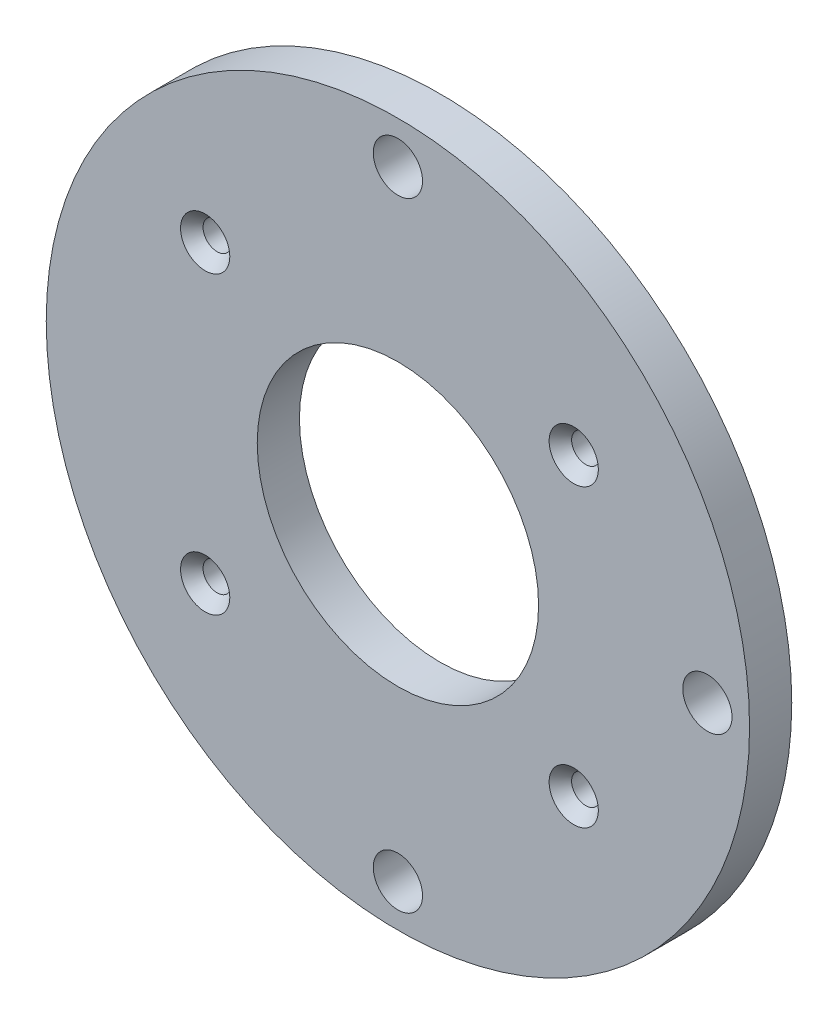
ISO-10303-21;
HEADER;
FILE_DESCRIPTION(('STEP AP214'),'2;1');
FILE_NAME('part.step','',(''),(''),'','','');
FILE_SCHEMA(('AUTOMOTIVE_DESIGN { 1 0 10303 214 1 1 1 1 }'));
ENDSEC;
DATA;
#1=APPLICATION_CONTEXT('core data for automotive mechanical design processes');
#2=APPLICATION_PROTOCOL_DEFINITION('international standard','automotive_design',2000,#1);
#3=PRODUCT_CONTEXT('',#1,'mechanical');
#4=PRODUCT('Part','Part','',(#3));
#5=PRODUCT_RELATED_PRODUCT_CATEGORY('part','',(#4));
#6=PRODUCT_DEFINITION_FORMATION('','',#4);
#7=PRODUCT_DEFINITION_CONTEXT('part definition',#1,'design');
#8=PRODUCT_DEFINITION('design','',#6,#7);
#9=PRODUCT_DEFINITION_SHAPE('','',#8);
#10=(LENGTH_UNIT() NAMED_UNIT(*) SI_UNIT(.MILLI.,.METRE.));
#11=(NAMED_UNIT(*) PLANE_ANGLE_UNIT() SI_UNIT($,.RADIAN.));
#12=(NAMED_UNIT(*) SI_UNIT($,.STERADIAN.) SOLID_ANGLE_UNIT());
#13=UNCERTAINTY_MEASURE_WITH_UNIT(LENGTH_MEASURE(1.E-05),#10,'distance_accuracy_value','');
#14=(GEOMETRIC_REPRESENTATION_CONTEXT(3) GLOBAL_UNCERTAINTY_ASSIGNED_CONTEXT((#13)) GLOBAL_UNIT_ASSIGNED_CONTEXT((#10,
#11,#12)) REPRESENTATION_CONTEXT('',''));
#15=CARTESIAN_POINT('',(0.,0.,0.));
#16=DIRECTION('',(0.,0.,1.));
#17=DIRECTION('',(1.,0.,0.));
#18=AXIS2_PLACEMENT_3D('',#15,#16,#17);
#19=CARTESIAN_POINT('',(0.,0.,0.));
#20=DIRECTION('',(0.,0.,1.));
#21=DIRECTION('',(1.,0.,0.));
#22=AXIS2_PLACEMENT_3D('',#19,#20,#21);
#23=CYLINDRICAL_SURFACE('',#22,25.);
#24=CARTESIAN_POINT('',(0.,0.,0.));
#25=DIRECTION('',(0.,0.,1.));
#26=DIRECTION('',(1.,0.,0.));
#27=AXIS2_PLACEMENT_3D('',#24,#25,#26);
#28=CIRCLE('',#27,25.);
#29=CARTESIAN_POINT('',(25.,0.,0.));
#30=VERTEX_POINT('',#29);
#31=EDGE_CURVE('E61',#30,#30,#28,.T.);
#32=ORIENTED_EDGE('',*,*,#31,.T.);
#33=EDGE_LOOP('',(#32));
#34=FACE_BOUND('',#33,.T.);
#35=CARTESIAN_POINT('',(0.,0.,3.));
#36=DIRECTION('',(0.,0.,1.));
#37=DIRECTION('',(1.,0.,0.));
#38=AXIS2_PLACEMENT_3D('',#35,#36,#37);
#39=CIRCLE('',#38,25.);
#40=CARTESIAN_POINT('',(25.,0.,3.));
#41=VERTEX_POINT('',#40);
#42=EDGE_CURVE('E64',#41,#41,#39,.T.);
#43=ORIENTED_EDGE('',*,*,#42,.F.);
#44=EDGE_LOOP('',(#43));
#45=FACE_BOUND('',#44,.T.);
#46=ADVANCED_FACE('F29',(#34,#45),#23,.T.);
#47=CARTESIAN_POINT('',(25.,0.,0.));
#48=DIRECTION('',(0.,0.,-1.));
#49=DIRECTION('',(-1.,0.,0.));
#50=AXIS2_PLACEMENT_3D('',#47,#48,#49);
#51=PLANE('',#50);
#52=CARTESIAN_POINT('',(22.,0.,0.));
#53=DIRECTION('',(0.,0.,1.));
#54=DIRECTION('',(1.,0.,0.));
#55=AXIS2_PLACEMENT_3D('',#52,#53,#54);
#56=CIRCLE('',#55,1.75000000000002);
#57=CARTESIAN_POINT('',(23.75,0.,0.));
#58=VERTEX_POINT('',#57);
#59=EDGE_CURVE('E97',#58,#58,#56,.T.);
#60=ORIENTED_EDGE('',*,*,#59,.T.);
#61=EDGE_LOOP('',(#60));
#62=FACE_BOUND('',#61,.T.);
#63=CARTESIAN_POINT('',(0.,0.,0.));
#64=DIRECTION('',(0.,0.,1.));
#65=DIRECTION('',(1.,0.,0.));
#66=AXIS2_PLACEMENT_3D('',#63,#64,#65);
#67=CIRCLE('',#66,10.);
#68=CARTESIAN_POINT('',(10.,0.,0.));
#69=VERTEX_POINT('',#68);
#70=EDGE_CURVE('E91',#69,#69,#67,.T.);
#71=ORIENTED_EDGE('',*,*,#70,.T.);
#72=EDGE_LOOP('',(#71));
#73=FACE_BOUND('',#72,.T.);
#74=CARTESIAN_POINT('',(0.,22.,0.));
#75=DIRECTION('',(0.,0.,1.));
#76=DIRECTION('',(1.,0.,0.));
#77=AXIS2_PLACEMENT_3D('',#74,#75,#76);
#78=CIRCLE('',#77,1.75000000000001);
#79=CARTESIAN_POINT('',(1.75000000000001,22.,0.));
#80=VERTEX_POINT('',#79);
#81=EDGE_CURVE('E85',#80,#80,#78,.T.);
#82=ORIENTED_EDGE('',*,*,#81,.T.);
#83=EDGE_LOOP('',(#82));
#84=FACE_BOUND('',#83,.T.);
#85=CARTESIAN_POINT('',(0.,-22.,0.));
#86=DIRECTION('',(0.,0.,1.));
#87=DIRECTION('',(1.,0.,0.));
#88=AXIS2_PLACEMENT_3D('',#85,#86,#87);
#89=CIRCLE('',#88,1.75000000000001);
#90=CARTESIAN_POINT('',(1.75000000000001,-22.,0.));
#91=VERTEX_POINT('',#90);
#92=EDGE_CURVE('E79',#91,#91,#89,.T.);
#93=ORIENTED_EDGE('',*,*,#92,.T.);
#94=EDGE_LOOP('',(#93));
#95=FACE_BOUND('',#94,.T.);
#96=CARTESIAN_POINT('',(12.5,-10.5,0.));
#97=DIRECTION('',(0.,0.,1.));
#98=DIRECTION('',(1.,0.,0.));
#99=AXIS2_PLACEMENT_3D('',#96,#97,#98);
#100=CIRCLE('',#99,1.00650000000001);
#101=CARTESIAN_POINT('',(13.5065,-10.5,0.));
#102=VERTEX_POINT('',#101);
#103=EDGE_CURVE('E76',#102,#102,#100,.T.);
#104=ORIENTED_EDGE('',*,*,#103,.T.);
#105=EDGE_LOOP('',(#104));
#106=FACE_BOUND('',#105,.T.);
#107=CARTESIAN_POINT('',(-13.7,10.5,0.));
#108=DIRECTION('',(0.,0.,1.));
#109=DIRECTION('',(1.,0.,0.));
#110=AXIS2_PLACEMENT_3D('',#107,#108,#109);
#111=CIRCLE('',#110,1.00650000000001);
#112=CARTESIAN_POINT('',(-12.6935,10.5,0.));
#113=VERTEX_POINT('',#112);
#114=EDGE_CURVE('E73',#113,#113,#111,.T.);
#115=ORIENTED_EDGE('',*,*,#114,.T.);
#116=EDGE_LOOP('',(#115));
#117=FACE_BOUND('',#116,.T.);
#118=CARTESIAN_POINT('',(12.5,10.5,0.));
#119=DIRECTION('',(0.,0.,1.));
#120=DIRECTION('',(1.,0.,0.));
#121=AXIS2_PLACEMENT_3D('',#118,#119,#120);
#122=CIRCLE('',#121,1.00650000000001);
#123=CARTESIAN_POINT('',(13.5065,10.5,0.));
#124=VERTEX_POINT('',#123);
#125=EDGE_CURVE('E70',#124,#124,#122,.T.);
#126=ORIENTED_EDGE('',*,*,#125,.T.);
#127=EDGE_LOOP('',(#126));
#128=FACE_BOUND('',#127,.T.);
#129=CARTESIAN_POINT('',(-13.7,-10.5,0.));
#130=DIRECTION('',(0.,0.,1.));
#131=DIRECTION('',(1.,0.,0.));
#132=AXIS2_PLACEMENT_3D('',#129,#130,#131);
#133=CIRCLE('',#132,1.00650000000001);
#134=CARTESIAN_POINT('',(-12.6935,-10.5,0.));
#135=VERTEX_POINT('',#134);
#136=EDGE_CURVE('E67',#135,#135,#133,.T.);
#137=ORIENTED_EDGE('',*,*,#136,.T.);
#138=EDGE_LOOP('',(#137));
#139=FACE_BOUND('',#138,.T.);
#140=ORIENTED_EDGE('',*,*,#31,.F.);
#141=EDGE_LOOP('',(#140));
#142=FACE_BOUND('',#141,.T.);
#143=ADVANCED_FACE('F110',(#62,#73,#84,#95,#106,#117,#128,#139,#142),#51,.T.);
#144=CARTESIAN_POINT('',(0.,0.,3.));
#145=DIRECTION('',(0.,0.,1.));
#146=DIRECTION('',(1.,0.,0.));
#147=AXIS2_PLACEMENT_3D('',#144,#145,#146);
#148=PLANE('',#147);
#149=CARTESIAN_POINT('',(-13.7,-10.5,3.));
#150=DIRECTION('',(0.,0.,1.));
#151=DIRECTION('',(1.,0.,0.));
#152=AXIS2_PLACEMENT_3D('',#149,#150,#151);
#153=CIRCLE('',#152,1.75000000001212);
#154=CARTESIAN_POINT('',(-11.9499999999879,-10.5,3.));
#155=VERTEX_POINT('',#154);
#156=EDGE_CURVE('E10',#155,#155,#153,.F.);
#157=ORIENTED_EDGE('',*,*,#156,.T.);
#158=EDGE_LOOP('',(#157));
#159=FACE_BOUND('',#158,.T.);
#160=CARTESIAN_POINT('',(12.5,10.5,3.));
#161=DIRECTION('',(0.,0.,1.));
#162=DIRECTION('',(1.,0.,0.));
#163=AXIS2_PLACEMENT_3D('',#160,#161,#162);
#164=CIRCLE('',#163,1.75000000001091);
#165=CARTESIAN_POINT('',(14.2500000000109,10.5,3.));
#166=VERTEX_POINT('',#165);
#167=EDGE_CURVE('E40',#166,#166,#164,.F.);
#168=ORIENTED_EDGE('',*,*,#167,.T.);
#169=EDGE_LOOP('',(#168));
#170=FACE_BOUND('',#169,.T.);
#171=CARTESIAN_POINT('',(12.5,-10.5,3.));
#172=DIRECTION('',(0.,0.,1.));
#173=DIRECTION('',(1.,0.,0.));
#174=AXIS2_PLACEMENT_3D('',#171,#172,#173);
#175=CIRCLE('',#174,1.74999999999286);
#176=CARTESIAN_POINT('',(14.2499999999929,-10.5,3.));
#177=VERTEX_POINT('',#176);
#178=EDGE_CURVE('E49',#177,#177,#175,.F.);
#179=ORIENTED_EDGE('',*,*,#178,.T.);
#180=EDGE_LOOP('',(#179));
#181=FACE_BOUND('',#180,.T.);
#182=CARTESIAN_POINT('',(-13.7,10.5,3.));
#183=DIRECTION('',(0.,0.,1.));
#184=DIRECTION('',(1.,0.,0.));
#185=AXIS2_PLACEMENT_3D('',#182,#183,#184);
#186=CIRCLE('',#185,1.74999999999409);
#187=CARTESIAN_POINT('',(-11.9500000000059,10.5,3.));
#188=VERTEX_POINT('',#187);
#189=EDGE_CURVE('E55',#188,#188,#186,.F.);
#190=ORIENTED_EDGE('',*,*,#189,.T.);
#191=EDGE_LOOP('',(#190));
#192=FACE_BOUND('',#191,.T.);
#193=CARTESIAN_POINT('',(22.,0.,3.));
#194=DIRECTION('',(0.,0.,1.));
#195=DIRECTION('',(1.,0.,0.));
#196=AXIS2_PLACEMENT_3D('',#193,#194,#195);
#197=CIRCLE('',#196,1.75000000000002);
#198=CARTESIAN_POINT('',(23.75,0.,3.));
#199=VERTEX_POINT('',#198);
#200=EDGE_CURVE('E100',#199,#199,#197,.T.);
#201=ORIENTED_EDGE('',*,*,#200,.F.);
#202=EDGE_LOOP('',(#201));
#203=FACE_BOUND('',#202,.T.);
#204=CARTESIAN_POINT('',(0.,0.,3.));
#205=DIRECTION('',(0.,0.,1.));
#206=DIRECTION('',(1.,0.,0.));
#207=AXIS2_PLACEMENT_3D('',#204,#205,#206);
#208=CIRCLE('',#207,10.);
#209=CARTESIAN_POINT('',(10.,0.,3.));
#210=VERTEX_POINT('',#209);
#211=EDGE_CURVE('E94',#210,#210,#208,.T.);
#212=ORIENTED_EDGE('',*,*,#211,.F.);
#213=EDGE_LOOP('',(#212));
#214=FACE_BOUND('',#213,.T.);
#215=CARTESIAN_POINT('',(0.,22.,3.));
#216=DIRECTION('',(0.,0.,1.));
#217=DIRECTION('',(1.,0.,0.));
#218=AXIS2_PLACEMENT_3D('',#215,#216,#217);
#219=CIRCLE('',#218,1.75000000000001);
#220=CARTESIAN_POINT('',(1.75000000000001,22.,3.));
#221=VERTEX_POINT('',#220);
#222=EDGE_CURVE('E88',#221,#221,#219,.T.);
#223=ORIENTED_EDGE('',*,*,#222,.F.);
#224=EDGE_LOOP('',(#223));
#225=FACE_BOUND('',#224,.T.);
#226=CARTESIAN_POINT('',(0.,-22.,3.));
#227=DIRECTION('',(0.,0.,1.));
#228=DIRECTION('',(1.,0.,0.));
#229=AXIS2_PLACEMENT_3D('',#226,#227,#228);
#230=CIRCLE('',#229,1.75000000000001);
#231=CARTESIAN_POINT('',(1.75000000000001,-22.,3.));
#232=VERTEX_POINT('',#231);
#233=EDGE_CURVE('E82',#232,#232,#230,.T.);
#234=ORIENTED_EDGE('',*,*,#233,.F.);
#235=EDGE_LOOP('',(#234));
#236=FACE_BOUND('',#235,.T.);
#237=ORIENTED_EDGE('',*,*,#42,.T.);
#238=EDGE_LOOP('',(#237));
#239=FACE_BOUND('',#238,.T.);
#240=ADVANCED_FACE('F106',(#159,#170,#181,#192,#203,#214,#225,#236,#239),#148,.T.);
#241=CARTESIAN_POINT('',(-13.7,-10.5,3.));
#242=DIRECTION('',(0.,0.,1.));
#243=DIRECTION('',(1.,0.,0.));
#244=AXIS2_PLACEMENT_3D('',#241,#242,#243);
#245=CYLINDRICAL_SURFACE('',#244,1.00650000000001);
#246=CARTESIAN_POINT('',(-13.7,-10.5,2.144701089263));
#247=DIRECTION('',(0.,0.,1.));
#248=DIRECTION('',(1.,0.,0.));
#249=AXIS2_PLACEMENT_3D('',#246,#247,#248);
#250=CIRCLE('',#249,1.00650000000001);
#251=CARTESIAN_POINT('',(-12.6935,-10.5,2.144701089263));
#252=VERTEX_POINT('',#251);
#253=EDGE_CURVE('E36',#252,#252,#250,.T.);
#254=ORIENTED_EDGE('',*,*,#253,.T.);
#255=EDGE_LOOP('',(#254));
#256=FACE_BOUND('',#255,.T.);
#257=ORIENTED_EDGE('',*,*,#136,.F.);
#258=EDGE_LOOP('',(#257));
#259=FACE_BOUND('',#258,.T.);
#260=ADVANCED_FACE('F109',(#256,#259),#245,.F.);
#261=CARTESIAN_POINT('',(12.5,10.5,3.));
#262=DIRECTION('',(0.,0.,1.));
#263=DIRECTION('',(1.,0.,0.));
#264=AXIS2_PLACEMENT_3D('',#261,#262,#263);
#265=CYLINDRICAL_SURFACE('',#264,1.00650000000001);
#266=CARTESIAN_POINT('',(12.5,10.5,2.14470108926439));
#267=DIRECTION('',(0.,0.,1.));
#268=DIRECTION('',(1.,0.,0.));
#269=AXIS2_PLACEMENT_3D('',#266,#267,#268);
#270=CIRCLE('',#269,1.00650000000001);
#271=CARTESIAN_POINT('',(13.5065,10.5,2.14470108926439));
#272=VERTEX_POINT('',#271);
#273=EDGE_CURVE('E44',#272,#272,#270,.T.);
#274=ORIENTED_EDGE('',*,*,#273,.T.);
#275=EDGE_LOOP('',(#274));
#276=FACE_BOUND('',#275,.T.);
#277=ORIENTED_EDGE('',*,*,#125,.F.);
#278=EDGE_LOOP('',(#277));
#279=FACE_BOUND('',#278,.T.);
#280=ADVANCED_FACE('F147',(#276,#279),#265,.F.);
#281=CARTESIAN_POINT('',(-13.7,10.5,3.));
#282=DIRECTION('',(0.,0.,1.));
#283=DIRECTION('',(1.,0.,0.));
#284=AXIS2_PLACEMENT_3D('',#281,#282,#283);
#285=CYLINDRICAL_SURFACE('',#284,1.00650000000001);
#286=CARTESIAN_POINT('',(-13.7,10.5,2.14470108920981));
#287=DIRECTION('',(0.,0.,1.));
#288=DIRECTION('',(1.,0.,0.));
#289=AXIS2_PLACEMENT_3D('',#286,#287,#288);
#290=CIRCLE('',#289,1.00650000000001);
#291=CARTESIAN_POINT('',(-12.6935,10.5,2.14470108920981));
#292=VERTEX_POINT('',#291);
#293=EDGE_CURVE('E58',#292,#292,#290,.T.);
#294=ORIENTED_EDGE('',*,*,#293,.T.);
#295=EDGE_LOOP('',(#294));
#296=FACE_BOUND('',#295,.T.);
#297=ORIENTED_EDGE('',*,*,#114,.F.);
#298=EDGE_LOOP('',(#297));
#299=FACE_BOUND('',#298,.T.);
#300=ADVANCED_FACE('F150',(#296,#299),#285,.F.);
#301=CARTESIAN_POINT('',(12.5,-10.5,3.));
#302=DIRECTION('',(0.,0.,1.));
#303=DIRECTION('',(1.,0.,0.));
#304=AXIS2_PLACEMENT_3D('',#301,#302,#303);
#305=CYLINDRICAL_SURFACE('',#304,1.00650000000001);
#306=CARTESIAN_POINT('',(12.5,-10.5,2.14470108921122));
#307=DIRECTION('',(0.,0.,1.));
#308=DIRECTION('',(1.,0.,0.));
#309=AXIS2_PLACEMENT_3D('',#306,#307,#308);
#310=CIRCLE('',#309,1.00650000000001);
#311=CARTESIAN_POINT('',(13.5065,-10.5,2.14470108921122));
#312=VERTEX_POINT('',#311);
#313=EDGE_CURVE('E52',#312,#312,#310,.T.);
#314=ORIENTED_EDGE('',*,*,#313,.T.);
#315=EDGE_LOOP('',(#314));
#316=FACE_BOUND('',#315,.T.);
#317=ORIENTED_EDGE('',*,*,#103,.F.);
#318=EDGE_LOOP('',(#317));
#319=FACE_BOUND('',#318,.T.);
#320=ADVANCED_FACE('F166',(#316,#319),#305,.F.);
#321=CARTESIAN_POINT('',(0.,-22.,3.));
#322=DIRECTION('',(0.,0.,1.));
#323=DIRECTION('',(1.,0.,0.));
#324=AXIS2_PLACEMENT_3D('',#321,#322,#323);
#325=CYLINDRICAL_SURFACE('',#324,1.75000000000001);
#326=ORIENTED_EDGE('',*,*,#92,.F.);
#327=EDGE_LOOP('',(#326));
#328=FACE_BOUND('',#327,.T.);
#329=ORIENTED_EDGE('',*,*,#233,.T.);
#330=EDGE_LOOP('',(#329));
#331=FACE_BOUND('',#330,.T.);
#332=ADVANCED_FACE('F170',(#328,#331),#325,.F.);
#333=CARTESIAN_POINT('',(0.,22.,3.));
#334=DIRECTION('',(0.,0.,1.));
#335=DIRECTION('',(1.,0.,0.));
#336=AXIS2_PLACEMENT_3D('',#333,#334,#335);
#337=CYLINDRICAL_SURFACE('',#336,1.75000000000001);
#338=ORIENTED_EDGE('',*,*,#81,.F.);
#339=EDGE_LOOP('',(#338));
#340=FACE_BOUND('',#339,.T.);
#341=ORIENTED_EDGE('',*,*,#222,.T.);
#342=EDGE_LOOP('',(#341));
#343=FACE_BOUND('',#342,.T.);
#344=ADVANCED_FACE('F174',(#340,#343),#337,.F.);
#345=CARTESIAN_POINT('',(0.,0.,3.));
#346=DIRECTION('',(0.,0.,1.));
#347=DIRECTION('',(1.,0.,0.));
#348=AXIS2_PLACEMENT_3D('',#345,#346,#347);
#349=CYLINDRICAL_SURFACE('',#348,10.);
#350=ORIENTED_EDGE('',*,*,#70,.F.);
#351=EDGE_LOOP('',(#350));
#352=FACE_BOUND('',#351,.T.);
#353=ORIENTED_EDGE('',*,*,#211,.T.);
#354=EDGE_LOOP('',(#353));
#355=FACE_BOUND('',#354,.T.);
#356=ADVANCED_FACE('F178',(#352,#355),#349,.F.);
#357=CARTESIAN_POINT('',(22.,0.,3.));
#358=DIRECTION('',(0.,0.,1.));
#359=DIRECTION('',(1.,0.,0.));
#360=AXIS2_PLACEMENT_3D('',#357,#358,#359);
#361=CYLINDRICAL_SURFACE('',#360,1.75000000000002);
#362=ORIENTED_EDGE('',*,*,#59,.F.);
#363=EDGE_LOOP('',(#362));
#364=FACE_BOUND('',#363,.T.);
#365=ORIENTED_EDGE('',*,*,#200,.T.);
#366=EDGE_LOOP('',(#365));
#367=FACE_BOUND('',#366,.T.);
#368=ADVANCED_FACE('F104',(#364,#367),#361,.F.);
#369=CARTESIAN_POINT('',(-13.7,10.5,2.14470108920981));
#370=DIRECTION('',(0.,0.,1.));
#371=DIRECTION('',(1.,0.,0.));
#372=AXIS2_PLACEMENT_3D('',#369,#370,#371);
#373=CONICAL_SURFACE('',#372,1.00650000000001,0.715584993301358);
#374=ORIENTED_EDGE('',*,*,#189,.F.);
#375=EDGE_LOOP('',(#374));
#376=FACE_BOUND('',#375,.T.);
#377=ORIENTED_EDGE('',*,*,#293,.F.);
#378=EDGE_LOOP('',(#377));
#379=FACE_BOUND('',#378,.T.);
#380=ADVANCED_FACE('F129',(#376,#379),#373,.F.);
#381=CARTESIAN_POINT('',(12.5,-10.5,2.14470108921122));
#382=DIRECTION('',(0.,0.,1.));
#383=DIRECTION('',(1.,0.,0.));
#384=AXIS2_PLACEMENT_3D('',#381,#382,#383);
#385=CONICAL_SURFACE('',#384,1.00650000000001,0.715584993301359);
#386=ORIENTED_EDGE('',*,*,#178,.F.);
#387=EDGE_LOOP('',(#386));
#388=FACE_BOUND('',#387,.T.);
#389=ORIENTED_EDGE('',*,*,#313,.F.);
#390=EDGE_LOOP('',(#389));
#391=FACE_BOUND('',#390,.T.);
#392=ADVANCED_FACE('F132',(#388,#391),#385,.F.);
#393=CARTESIAN_POINT('',(12.5,10.5,2.14470108926439));
#394=DIRECTION('',(0.,0.,1.));
#395=DIRECTION('',(1.,0.,0.));
#396=AXIS2_PLACEMENT_3D('',#393,#394,#395);
#397=CONICAL_SURFACE('',#396,1.00650000000001,0.715584993344157);
#398=ORIENTED_EDGE('',*,*,#167,.F.);
#399=EDGE_LOOP('',(#398));
#400=FACE_BOUND('',#399,.T.);
#401=ORIENTED_EDGE('',*,*,#273,.F.);
#402=EDGE_LOOP('',(#401));
#403=FACE_BOUND('',#402,.T.);
#404=ADVANCED_FACE('F135',(#400,#403),#397,.F.);
#405=CARTESIAN_POINT('',(-13.7,-10.5,2.144701089263));
#406=DIRECTION('',(0.,0.,1.));
#407=DIRECTION('',(1.,0.,0.));
#408=AXIS2_PLACEMENT_3D('',#405,#406,#407);
#409=CONICAL_SURFACE('',#408,1.00650000000001,0.715584993344158);
#410=ORIENTED_EDGE('',*,*,#156,.F.);
#411=EDGE_LOOP('',(#410));
#412=FACE_BOUND('',#411,.T.);
#413=ORIENTED_EDGE('',*,*,#253,.F.);
#414=EDGE_LOOP('',(#413));
#415=FACE_BOUND('',#414,.T.);
#416=ADVANCED_FACE('F31',(#412,#415),#409,.F.);
#417=CLOSED_SHELL('',(#46,#143,#240,#260,#280,#300,#320,#332,#344,#356,#368,#380,#392,#404,#416));
#418=MANIFOLD_SOLID_BREP('B2',#417);
#419=ADVANCED_BREP_SHAPE_REPRESENTATION('',(#18,#418),#14);
#420=SHAPE_DEFINITION_REPRESENTATION(#9,#419);
ENDSEC;
END-ISO-10303-21;
